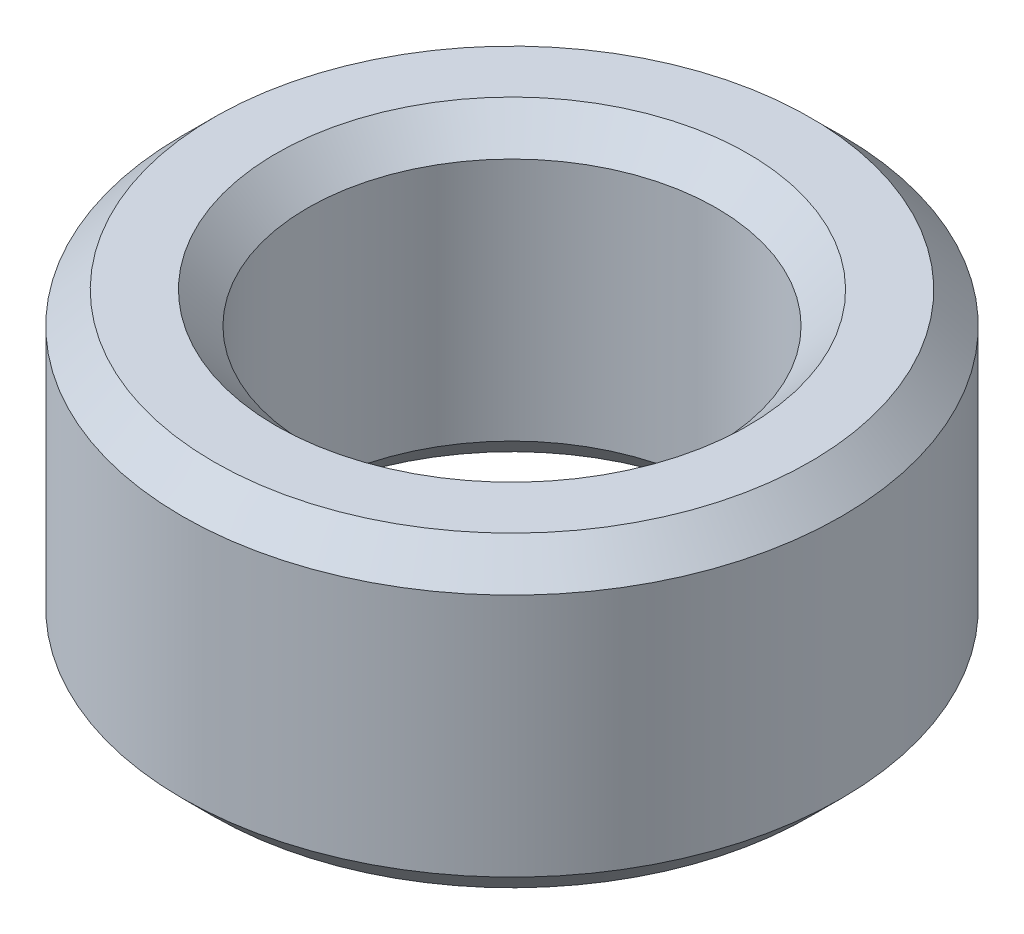
ISO-10303-21;
HEADER;
FILE_DESCRIPTION(('STEP AP214'),'2;1');
FILE_NAME('part.step','',(''),(''),'','','');
FILE_SCHEMA(('AUTOMOTIVE_DESIGN { 1 0 10303 214 1 1 1 1 }'));
ENDSEC;
DATA;
#1=APPLICATION_CONTEXT('core data for automotive mechanical design processes');
#2=APPLICATION_PROTOCOL_DEFINITION('international standard','automotive_design',2000,#1);
#3=PRODUCT_CONTEXT('',#1,'mechanical');
#4=PRODUCT('Part','Part','',(#3));
#5=PRODUCT_RELATED_PRODUCT_CATEGORY('part','',(#4));
#6=PRODUCT_DEFINITION_FORMATION('','',#4);
#7=PRODUCT_DEFINITION_CONTEXT('part definition',#1,'design');
#8=PRODUCT_DEFINITION('design','',#6,#7);
#9=PRODUCT_DEFINITION_SHAPE('','',#8);
#10=(LENGTH_UNIT() NAMED_UNIT(*) SI_UNIT(.MILLI.,.METRE.));
#11=(NAMED_UNIT(*) PLANE_ANGLE_UNIT() SI_UNIT($,.RADIAN.));
#12=(NAMED_UNIT(*) SI_UNIT($,.STERADIAN.) SOLID_ANGLE_UNIT());
#13=UNCERTAINTY_MEASURE_WITH_UNIT(LENGTH_MEASURE(1.E-05),#10,'distance_accuracy_value','');
#14=(GEOMETRIC_REPRESENTATION_CONTEXT(3) GLOBAL_UNCERTAINTY_ASSIGNED_CONTEXT((#13)) GLOBAL_UNIT_ASSIGNED_CONTEXT((#10,
#11,#12)) REPRESENTATION_CONTEXT('',''));
#15=CARTESIAN_POINT('',(0.,0.,0.));
#16=DIRECTION('',(0.,0.,1.));
#17=DIRECTION('',(1.,0.,0.));
#18=AXIS2_PLACEMENT_3D('',#15,#16,#17);
#19=CARTESIAN_POINT('',(0.,34.9344313199229,0.));
#20=DIRECTION('',(0.,-1.,0.));
#21=DIRECTION('',(0.,0.,-1.));
#22=AXIS2_PLACEMENT_3D('',#19,#20,#21);
#23=CYLINDRICAL_SURFACE('',#22,37.5);
#24=CARTESIAN_POINT('',(0.,3.57795942103878,0.));
#25=DIRECTION('',(0.,1.,0.));
#26=DIRECTION('',(0.,0.,1.));
#27=AXIS2_PLACEMENT_3D('',#24,#25,#26);
#28=CIRCLE('',#27,37.5);
#29=CARTESIAN_POINT('',(0.,3.57795942103878,37.5));
#30=VERTEX_POINT('',#29);
#31=EDGE_CURVE('E10',#30,#30,#28,.T.);
#32=ORIENTED_EDGE('',*,*,#31,.T.);
#33=EDGE_LOOP('',(#32));
#34=FACE_BOUND('',#33,.T.);
#35=CARTESIAN_POINT('',(0.,31.3564718988841,0.));
#36=DIRECTION('',(0.,1.,0.));
#37=DIRECTION('',(0.,0.,1.));
#38=AXIS2_PLACEMENT_3D('',#35,#36,#37);
#39=CIRCLE('',#38,37.5);
#40=CARTESIAN_POINT('',(0.,31.3564718988841,37.5));
#41=VERTEX_POINT('',#40);
#42=EDGE_CURVE('E50',#41,#41,#39,.F.);
#43=ORIENTED_EDGE('',*,*,#42,.T.);
#44=EDGE_LOOP('',(#43));
#45=FACE_BOUND('',#44,.T.);
#46=ADVANCED_FACE('F39',(#34,#45),#23,.T.);
#47=CARTESIAN_POINT('',(0.,34.9344313199229,0.));
#48=DIRECTION('',(0.,1.,0.));
#49=DIRECTION('',(0.,0.,1.));
#50=AXIS2_PLACEMENT_3D('',#47,#48,#49);
#51=PLANE('',#50);
#52=CARTESIAN_POINT('',(0.,34.9344313199229,0.));
#53=DIRECTION('',(0.,1.,0.));
#54=DIRECTION('',(0.,0.,1.));
#55=AXIS2_PLACEMENT_3D('',#52,#53,#54);
#56=CIRCLE('',#55,26.8294079180046);
#57=CARTESIAN_POINT('',(0.,34.9344313199229,26.8294079180046));
#58=VERTEX_POINT('',#57);
#59=EDGE_CURVE('E58',#58,#58,#56,.F.);
#60=ORIENTED_EDGE('',*,*,#59,.T.);
#61=EDGE_LOOP('',(#60));
#62=FACE_BOUND('',#61,.T.);
#63=CARTESIAN_POINT('',(0.,34.9344313199229,0.));
#64=DIRECTION('',(0.,1.,0.));
#65=DIRECTION('',(0.,0.,1.));
#66=AXIS2_PLACEMENT_3D('',#63,#64,#65);
#67=CIRCLE('',#66,33.9220405789612);
#68=CARTESIAN_POINT('',(0.,34.9344313199229,33.9220405789612));
#69=VERTEX_POINT('',#68);
#70=EDGE_CURVE('E61',#69,#69,#67,.T.);
#71=ORIENTED_EDGE('',*,*,#70,.T.);
#72=EDGE_LOOP('',(#71));
#73=FACE_BOUND('',#72,.T.);
#74=ADVANCED_FACE('F88',(#62,#73),#51,.T.);
#75=CARTESIAN_POINT('',(0.,0.,0.));
#76=DIRECTION('',(0.,1.,0.));
#77=DIRECTION('',(0.,0.,1.));
#78=AXIS2_PLACEMENT_3D('',#75,#76,#77);
#79=PLANE('',#78);
#80=CARTESIAN_POINT('',(0.,0.,0.));
#81=DIRECTION('',(0.,1.,0.));
#82=DIRECTION('',(0.,0.,1.));
#83=AXIS2_PLACEMENT_3D('',#80,#81,#82);
#84=CIRCLE('',#83,26.8294079180046);
#85=CARTESIAN_POINT('',(0.,0.,26.8294079180046));
#86=VERTEX_POINT('',#85);
#87=EDGE_CURVE('E51',#86,#86,#84,.T.);
#88=ORIENTED_EDGE('',*,*,#87,.T.);
#89=EDGE_LOOP('',(#88));
#90=FACE_BOUND('',#89,.T.);
#91=CARTESIAN_POINT('',(0.,0.,0.));
#92=DIRECTION('',(0.,1.,0.));
#93=DIRECTION('',(0.,0.,1.));
#94=AXIS2_PLACEMENT_3D('',#91,#92,#93);
#95=CIRCLE('',#94,33.9220405789612);
#96=CARTESIAN_POINT('',(0.,0.,33.9220405789612));
#97=VERTEX_POINT('',#96);
#98=EDGE_CURVE('E54',#97,#97,#95,.F.);
#99=ORIENTED_EDGE('',*,*,#98,.T.);
#100=EDGE_LOOP('',(#99));
#101=FACE_BOUND('',#100,.T.);
#102=ADVANCED_FACE('F83',(#90,#101),#79,.F.);
#103=CARTESIAN_POINT('',(0.,34.9344313199229,0.));
#104=DIRECTION('',(0.,-1.,0.));
#105=DIRECTION('',(0.,0.,-1.));
#106=AXIS2_PLACEMENT_3D('',#103,#104,#105);
#107=CYLINDRICAL_SURFACE('',#106,23.2514484969658);
#108=CARTESIAN_POINT('',(0.,31.3564718988842,0.));
#109=DIRECTION('',(0.,1.,0.));
#110=DIRECTION('',(0.,0.,1.));
#111=AXIS2_PLACEMENT_3D('',#108,#109,#110);
#112=CIRCLE('',#111,23.2514484969658);
#113=CARTESIAN_POINT('',(0.,31.3564718988842,23.2514484969658));
#114=VERTEX_POINT('',#113);
#115=EDGE_CURVE('E67',#114,#114,#112,.T.);
#116=ORIENTED_EDGE('',*,*,#115,.T.);
#117=EDGE_LOOP('',(#116));
#118=FACE_BOUND('',#117,.T.);
#119=CARTESIAN_POINT('',(0.,3.57795942103881,0.));
#120=DIRECTION('',(0.,1.,0.));
#121=DIRECTION('',(0.,0.,1.));
#122=AXIS2_PLACEMENT_3D('',#119,#120,#121);
#123=CIRCLE('',#122,23.2514484969658);
#124=CARTESIAN_POINT('',(0.,3.57795942103881,23.2514484969658));
#125=VERTEX_POINT('',#124);
#126=EDGE_CURVE('E69',#125,#125,#123,.F.);
#127=ORIENTED_EDGE('',*,*,#126,.T.);
#128=EDGE_LOOP('',(#127));
#129=FACE_BOUND('',#128,.T.);
#130=ADVANCED_FACE('F71',(#118,#129),#107,.F.);
#131=CARTESIAN_POINT('',(0.,31.3564718988842,0.));
#132=DIRECTION('',(0.,1.,0.));
#133=DIRECTION('',(0.,0.,1.));
#134=AXIS2_PLACEMENT_3D('',#131,#132,#133);
#135=CONICAL_SURFACE('',#134,23.2514484969658,0.785398163397453);
#136=ORIENTED_EDGE('',*,*,#59,.F.);
#137=EDGE_LOOP('',(#136));
#138=FACE_BOUND('',#137,.T.);
#139=ORIENTED_EDGE('',*,*,#115,.F.);
#140=EDGE_LOOP('',(#139));
#141=FACE_BOUND('',#140,.T.);
#142=ADVANCED_FACE('F77',(#138,#141),#135,.F.);
#143=CARTESIAN_POINT('',(0.,0.,0.));
#144=DIRECTION('',(0.,-1.,0.));
#145=DIRECTION('',(0.,0.,-1.));
#146=AXIS2_PLACEMENT_3D('',#143,#144,#145);
#147=CONICAL_SURFACE('',#146,26.8294079180046,0.785398163397443);
#148=ORIENTED_EDGE('',*,*,#126,.F.);
#149=EDGE_LOOP('',(#148));
#150=FACE_BOUND('',#149,.T.);
#151=ORIENTED_EDGE('',*,*,#87,.F.);
#152=EDGE_LOOP('',(#151));
#153=FACE_BOUND('',#152,.T.);
#154=ADVANCED_FACE('F73',(#150,#153),#147,.F.);
#155=CARTESIAN_POINT('',(0.,3.57795942103878,0.));
#156=DIRECTION('',(0.,1.,0.));
#157=DIRECTION('',(0.,0.,1.));
#158=AXIS2_PLACEMENT_3D('',#155,#156,#157);
#159=CONICAL_SURFACE('',#158,37.5,0.785398163397453);
#160=ORIENTED_EDGE('',*,*,#98,.F.);
#161=EDGE_LOOP('',(#160));
#162=FACE_BOUND('',#161,.T.);
#163=ORIENTED_EDGE('',*,*,#31,.F.);
#164=EDGE_LOOP('',(#163));
#165=FACE_BOUND('',#164,.T.);
#166=ADVANCED_FACE('F76',(#162,#165),#159,.T.);
#167=CARTESIAN_POINT('',(0.,34.9344313199229,0.));
#168=DIRECTION('',(0.,-1.,0.));
#169=DIRECTION('',(0.,0.,-1.));
#170=AXIS2_PLACEMENT_3D('',#167,#168,#169);
#171=CONICAL_SURFACE('',#170,33.9220405789612,0.785398163397443);
#172=ORIENTED_EDGE('',*,*,#42,.F.);
#173=EDGE_LOOP('',(#172));
#174=FACE_BOUND('',#173,.T.);
#175=ORIENTED_EDGE('',*,*,#70,.F.);
#176=EDGE_LOOP('',(#175));
#177=FACE_BOUND('',#176,.T.);
#178=ADVANCED_FACE('F45',(#174,#177),#171,.T.);
#179=CLOSED_SHELL('',(#46,#74,#102,#130,#142,#154,#166,#178));
#180=MANIFOLD_SOLID_BREP('B2',#179);
#181=ADVANCED_BREP_SHAPE_REPRESENTATION('',(#18,#180),#14);
#182=SHAPE_DEFINITION_REPRESENTATION(#9,#181);
ENDSEC;
END-ISO-10303-21;
